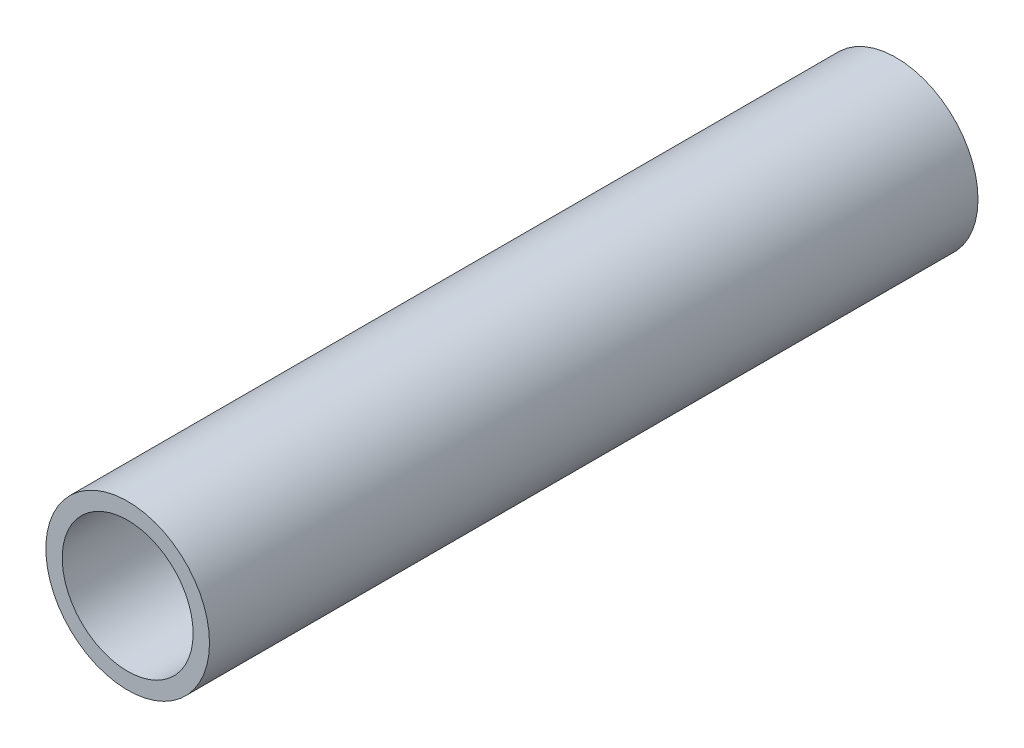
ISO-10303-21;
HEADER;
FILE_DESCRIPTION(('STEP AP214'),'2;1');
FILE_NAME('part.step','',(''),(''),'','','');
FILE_SCHEMA(('AUTOMOTIVE_DESIGN { 1 0 10303 214 1 1 1 1 }'));
ENDSEC;
DATA;
#1=APPLICATION_CONTEXT('core data for automotive mechanical design processes');
#2=APPLICATION_PROTOCOL_DEFINITION('international standard','automotive_design',2000,#1);
#3=PRODUCT_CONTEXT('',#1,'mechanical');
#4=PRODUCT('Part','Part','',(#3));
#5=PRODUCT_RELATED_PRODUCT_CATEGORY('part','',(#4));
#6=PRODUCT_DEFINITION_FORMATION('','',#4);
#7=PRODUCT_DEFINITION_CONTEXT('part definition',#1,'design');
#8=PRODUCT_DEFINITION('design','',#6,#7);
#9=PRODUCT_DEFINITION_SHAPE('','',#8);
#10=(LENGTH_UNIT() NAMED_UNIT(*) SI_UNIT(.MILLI.,.METRE.));
#11=(NAMED_UNIT(*) PLANE_ANGLE_UNIT() SI_UNIT($,.RADIAN.));
#12=(NAMED_UNIT(*) SI_UNIT($,.STERADIAN.) SOLID_ANGLE_UNIT());
#13=UNCERTAINTY_MEASURE_WITH_UNIT(LENGTH_MEASURE(1.E-05),#10,'distance_accuracy_value','');
#14=(GEOMETRIC_REPRESENTATION_CONTEXT(3) GLOBAL_UNCERTAINTY_ASSIGNED_CONTEXT((#13)) GLOBAL_UNIT_ASSIGNED_CONTEXT((#10,
#11,#12)) REPRESENTATION_CONTEXT('',''));
#15=CARTESIAN_POINT('',(0.,0.,0.));
#16=DIRECTION('',(0.,0.,1.));
#17=DIRECTION('',(1.,0.,0.));
#18=AXIS2_PLACEMENT_3D('',#15,#16,#17);
#19=CARTESIAN_POINT('',(0.,0.,11.74));
#20=DIRECTION('',(0.,0.,1.));
#21=DIRECTION('',(1.,0.,0.));
#22=AXIS2_PLACEMENT_3D('',#19,#20,#21);
#23=PLANE('',#22);
#24=CARTESIAN_POINT('',(0.,0.,11.74));
#25=DIRECTION('',(0.,0.,1.));
#26=DIRECTION('',(1.,0.,0.));
#27=AXIS2_PLACEMENT_3D('',#24,#25,#26);
#28=CIRCLE('',#27,1.25);
#29=CARTESIAN_POINT('',(1.25,0.,11.74));
#30=VERTEX_POINT('',#29);
#31=EDGE_CURVE('E10',#30,#30,#28,.T.);
#32=ORIENTED_EDGE('',*,*,#31,.T.);
#33=EDGE_LOOP('',(#32));
#34=FACE_BOUND('',#33,.T.);
#35=CARTESIAN_POINT('',(0.,0.,11.74));
#36=DIRECTION('',(0.,0.,1.));
#37=DIRECTION('',(1.,0.,0.));
#38=AXIS2_PLACEMENT_3D('',#35,#36,#37);
#39=CIRCLE('',#38,1.);
#40=CARTESIAN_POINT('',(1.,0.,11.74));
#41=VERTEX_POINT('',#40);
#42=EDGE_CURVE('E41',#41,#41,#39,.T.);
#43=ORIENTED_EDGE('',*,*,#42,.F.);
#44=EDGE_LOOP('',(#43));
#45=FACE_BOUND('',#44,.T.);
#46=ADVANCED_FACE('F30',(#34,#45),#23,.T.);
#47=CARTESIAN_POINT('',(0.,0.,0.));
#48=DIRECTION('',(0.,0.,1.));
#49=DIRECTION('',(1.,0.,0.));
#50=AXIS2_PLACEMENT_3D('',#47,#48,#49);
#51=PLANE('',#50);
#52=CARTESIAN_POINT('',(0.,0.,0.));
#53=DIRECTION('',(0.,0.,1.));
#54=DIRECTION('',(1.,0.,0.));
#55=AXIS2_PLACEMENT_3D('',#52,#53,#54);
#56=CIRCLE('',#55,1.25);
#57=CARTESIAN_POINT('',(1.25,0.,0.));
#58=VERTEX_POINT('',#57);
#59=EDGE_CURVE('E34',#58,#58,#56,.T.);
#60=ORIENTED_EDGE('',*,*,#59,.F.);
#61=EDGE_LOOP('',(#60));
#62=FACE_BOUND('',#61,.T.);
#63=CARTESIAN_POINT('',(0.,0.,0.));
#64=DIRECTION('',(0.,0.,1.));
#65=DIRECTION('',(1.,0.,0.));
#66=AXIS2_PLACEMENT_3D('',#63,#64,#65);
#67=CIRCLE('',#66,1.);
#68=CARTESIAN_POINT('',(1.,0.,0.));
#69=VERTEX_POINT('',#68);
#70=EDGE_CURVE('E43',#69,#69,#67,.T.);
#71=ORIENTED_EDGE('',*,*,#70,.T.);
#72=EDGE_LOOP('',(#71));
#73=FACE_BOUND('',#72,.T.);
#74=ADVANCED_FACE('F53',(#62,#73),#51,.F.);
#75=CARTESIAN_POINT('',(0.,0.,11.74));
#76=DIRECTION('',(0.,0.,-1.));
#77=DIRECTION('',(-1.,0.,0.));
#78=AXIS2_PLACEMENT_3D('',#75,#76,#77);
#79=CYLINDRICAL_SURFACE('',#78,1.25);
#80=ORIENTED_EDGE('',*,*,#31,.F.);
#81=EDGE_LOOP('',(#80));
#82=FACE_BOUND('',#81,.T.);
#83=ORIENTED_EDGE('',*,*,#59,.T.);
#84=EDGE_LOOP('',(#83));
#85=FACE_BOUND('',#84,.T.);
#86=ADVANCED_FACE('F32',(#82,#85),#79,.T.);
#87=CARTESIAN_POINT('',(0.,0.,11.74));
#88=DIRECTION('',(0.,0.,-1.));
#89=DIRECTION('',(-1.,0.,0.));
#90=AXIS2_PLACEMENT_3D('',#87,#88,#89);
#91=CYLINDRICAL_SURFACE('',#90,1.);
#92=ORIENTED_EDGE('',*,*,#42,.T.);
#93=EDGE_LOOP('',(#92));
#94=FACE_BOUND('',#93,.T.);
#95=ORIENTED_EDGE('',*,*,#70,.F.);
#96=EDGE_LOOP('',(#95));
#97=FACE_BOUND('',#96,.T.);
#98=ADVANCED_FACE('F49',(#94,#97),#91,.F.);
#99=CLOSED_SHELL('',(#46,#74,#86,#98));
#100=MANIFOLD_SOLID_BREP('B2',#99);
#101=ADVANCED_BREP_SHAPE_REPRESENTATION('',(#18,#100),#14);
#102=SHAPE_DEFINITION_REPRESENTATION(#9,#101);
ENDSEC;
END-ISO-10303-21;
